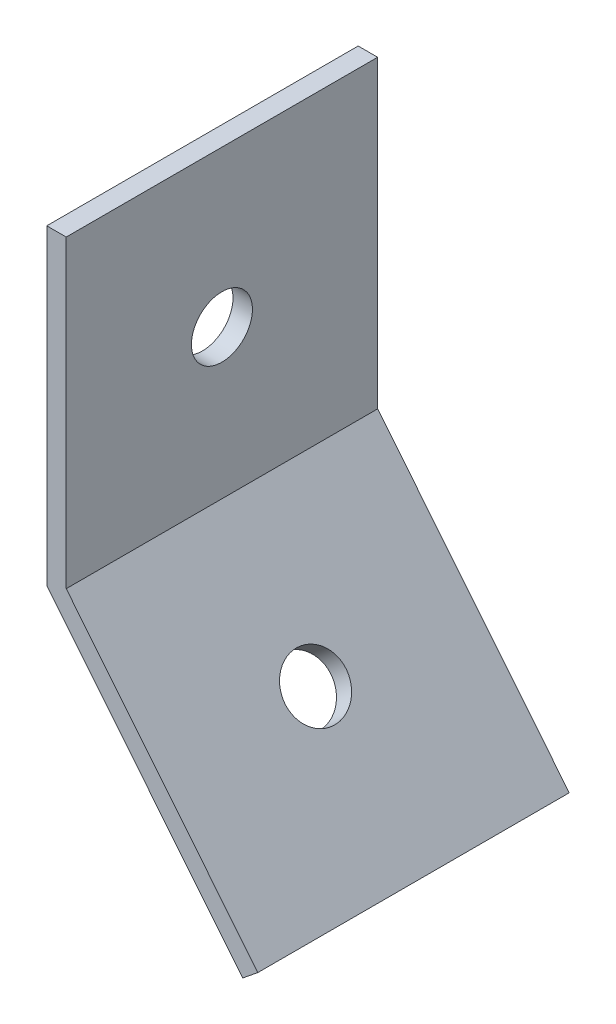
ISO-10303-21;
HEADER;
FILE_DESCRIPTION(('STEP AP214'),'2;1');
FILE_NAME('part.step','',(''),(''),'','','');
FILE_SCHEMA(('AUTOMOTIVE_DESIGN { 1 0 10303 214 1 1 1 1 }'));
ENDSEC;
DATA;
#1=APPLICATION_CONTEXT('core data for automotive mechanical design processes');
#2=APPLICATION_PROTOCOL_DEFINITION('international standard','automotive_design',2000,#1);
#3=PRODUCT_CONTEXT('',#1,'mechanical');
#4=PRODUCT('Part','Part','',(#3));
#5=PRODUCT_RELATED_PRODUCT_CATEGORY('part','',(#4));
#6=PRODUCT_DEFINITION_FORMATION('','',#4);
#7=PRODUCT_DEFINITION_CONTEXT('part definition',#1,'design');
#8=PRODUCT_DEFINITION('design','',#6,#7);
#9=PRODUCT_DEFINITION_SHAPE('','',#8);
#10=(LENGTH_UNIT() NAMED_UNIT(*) SI_UNIT(.MILLI.,.METRE.));
#11=(NAMED_UNIT(*) PLANE_ANGLE_UNIT() SI_UNIT($,.RADIAN.));
#12=(NAMED_UNIT(*) SI_UNIT($,.STERADIAN.) SOLID_ANGLE_UNIT());
#13=UNCERTAINTY_MEASURE_WITH_UNIT(LENGTH_MEASURE(1.E-05),#10,'distance_accuracy_value','');
#14=(GEOMETRIC_REPRESENTATION_CONTEXT(3) GLOBAL_UNCERTAINTY_ASSIGNED_CONTEXT((#13)) GLOBAL_UNIT_ASSIGNED_CONTEXT((#10,
#11,#12)) REPRESENTATION_CONTEXT('',''));
#15=CARTESIAN_POINT('',(0.,0.,0.));
#16=DIRECTION('',(0.,0.,1.));
#17=DIRECTION('',(1.,0.,0.));
#18=AXIS2_PLACEMENT_3D('',#15,#16,#17);
#19=CARTESIAN_POINT('',(50.8,736.60000000001,-25.4));
#20=DIRECTION('',(-0.777233462324333,-0.629212321115321,0.));
#21=DIRECTION('',(0.629212321115321,-0.777233462324333,0.));
#22=AXIS2_PLACEMENT_3D('',#19,#20,#21);
#23=PLANE('',#22);
#24=CARTESIAN_POINT('',(58.7909964781645,726.729135028491,-12.7));
#25=DIRECTION('',(-0.777233462324333,-0.629212321115321,0.));
#26=DIRECTION('',(0.629212321115321,-0.777233462324333,0.));
#27=AXIS2_PLACEMENT_3D('',#24,#25,#26);
#28=CIRCLE('',#27,2.48919999999999);
#29=CARTESIAN_POINT('',(60.3572317878848,724.794445494073,-12.7));
#30=VERTEX_POINT('',#29);
#31=EDGE_CURVE('E121',#30,#30,#28,.T.);
#32=ORIENTED_EDGE('',*,*,#31,.F.);
#33=EDGE_LOOP('',(#32));
#34=FACE_BOUND('',#33,.T.);
#35=DIRECTION('',(0.629212321115321,-0.777233462324333,0.));
#36=VECTOR('',#35,1.);
#37=CARTESIAN_POINT('',(50.8,736.60000000001,0.));
#38=LINE('',#37,#36);
#39=CARTESIAN_POINT('',(50.8,736.60000000001,0.));
#40=VERTEX_POINT('',#39);
#41=CARTESIAN_POINT('',(66.7819929563291,716.858270056972,0.));
#42=VERTEX_POINT('',#41);
#43=EDGE_CURVE('E117',#40,#42,#38,.T.);
#44=ORIENTED_EDGE('',*,*,#43,.F.);
#45=DIRECTION('',(0.,0.,1.));
#46=VECTOR('',#45,1.);
#47=CARTESIAN_POINT('',(50.8,736.60000000001,-25.4));
#48=LINE('',#47,#46);
#49=CARTESIAN_POINT('',(50.8,736.60000000001,-25.4));
#50=VERTEX_POINT('',#49);
#51=EDGE_CURVE('E11',#50,#40,#48,.T.);
#52=ORIENTED_EDGE('',*,*,#51,.F.);
#53=DIRECTION('',(0.629212321115321,-0.777233462324333,0.));
#54=VECTOR('',#53,1.);
#55=CARTESIAN_POINT('',(50.8,736.60000000001,-25.4));
#56=LINE('',#55,#54);
#57=CARTESIAN_POINT('',(66.7819929563291,716.858270056972,-25.4));
#58=VERTEX_POINT('',#57);
#59=EDGE_CURVE('E131',#50,#58,#56,.T.);
#60=ORIENTED_EDGE('',*,*,#59,.T.);
#61=DIRECTION('',(0.,0.,1.));
#62=VECTOR('',#61,1.);
#63=CARTESIAN_POINT('',(66.7819929563291,716.858270056972,-25.4));
#64=LINE('',#63,#62);
#65=EDGE_CURVE('E38',#58,#42,#64,.T.);
#66=ORIENTED_EDGE('',*,*,#65,.T.);
#67=EDGE_LOOP('',(#44,#52,#60,#66));
#68=FACE_BOUND('',#67,.T.);
#69=ADVANCED_FACE('F35',(#34,#68),#23,.T.);
#70=CARTESIAN_POINT('',(50.8,762.00000000001,-25.4));
#71=DIRECTION('',(-1.,0.,0.));
#72=DIRECTION('',(0.,0.,1.));
#73=AXIS2_PLACEMENT_3D('',#70,#71,#72);
#74=PLANE('',#73);
#75=CARTESIAN_POINT('',(50.8,749.30000000001,-12.7));
#76=DIRECTION('',(-1.,0.,0.));
#77=DIRECTION('',(0.,0.,1.));
#78=AXIS2_PLACEMENT_3D('',#75,#76,#77);
#79=CIRCLE('',#78,2.48919999999997);
#80=CARTESIAN_POINT('',(50.8,749.30000000001,-10.2108));
#81=VERTEX_POINT('',#80);
#82=EDGE_CURVE('E185',#81,#81,#79,.T.);
#83=ORIENTED_EDGE('',*,*,#82,.F.);
#84=EDGE_LOOP('',(#83));
#85=FACE_BOUND('',#84,.T.);
#86=DIRECTION('',(0.,-1.,0.));
#87=VECTOR('',#86,1.);
#88=CARTESIAN_POINT('',(50.8,762.00000000001,0.));
#89=LINE('',#88,#87);
#90=CARTESIAN_POINT('',(50.8,762.00000000001,0.));
#91=VERTEX_POINT('',#90);
#92=EDGE_CURVE('E129',#91,#40,#89,.T.);
#93=ORIENTED_EDGE('',*,*,#92,.F.);
#94=DIRECTION('',(0.,0.,1.));
#95=VECTOR('',#94,1.);
#96=CARTESIAN_POINT('',(50.8,762.00000000001,-25.4));
#97=LINE('',#96,#95);
#98=CARTESIAN_POINT('',(50.8,762.00000000001,-25.4));
#99=VERTEX_POINT('',#98);
#100=EDGE_CURVE('E44',#99,#91,#97,.T.);
#101=ORIENTED_EDGE('',*,*,#100,.F.);
#102=DIRECTION('',(0.,-1.,0.));
#103=VECTOR('',#102,1.);
#104=CARTESIAN_POINT('',(50.8,762.00000000001,-25.4));
#105=LINE('',#104,#103);
#106=EDGE_CURVE('E98',#99,#50,#105,.T.);
#107=ORIENTED_EDGE('',*,*,#106,.T.);
#108=ORIENTED_EDGE('',*,*,#51,.T.);
#109=EDGE_LOOP('',(#93,#101,#107,#108));
#110=FACE_BOUND('',#109,.T.);
#111=ADVANCED_FACE('F143',(#85,#110),#74,.T.);
#112=CARTESIAN_POINT('',(50.8,762.00000000001,-25.4));
#113=DIRECTION('',(0.,-1.,0.));
#114=DIRECTION('',(0.,0.,-1.));
#115=AXIS2_PLACEMENT_3D('',#112,#113,#114);
#116=PLANE('',#115);
#117=DIRECTION('',(1.,0.,0.));
#118=VECTOR('',#117,1.);
#119=CARTESIAN_POINT('',(50.8,762.00000000001,0.));
#120=LINE('',#119,#118);
#121=CARTESIAN_POINT('',(52.3875,762.00000000001,0.));
#122=VERTEX_POINT('',#121);
#123=EDGE_CURVE('E103',#91,#122,#120,.T.);
#124=ORIENTED_EDGE('',*,*,#123,.T.);
#125=DIRECTION('',(0.,0.,1.));
#126=VECTOR('',#125,1.);
#127=CARTESIAN_POINT('',(52.3875,762.00000000001,-25.4));
#128=LINE('',#127,#126);
#129=CARTESIAN_POINT('',(52.3875,762.00000000001,-25.4));
#130=VERTEX_POINT('',#129);
#131=EDGE_CURVE('E101',#130,#122,#128,.T.);
#132=ORIENTED_EDGE('',*,*,#131,.F.);
#133=DIRECTION('',(1.,0.,0.));
#134=VECTOR('',#133,1.);
#135=CARTESIAN_POINT('',(50.8,762.00000000001,-25.4));
#136=LINE('',#135,#134);
#137=EDGE_CURVE('E92',#99,#130,#136,.T.);
#138=ORIENTED_EDGE('',*,*,#137,.F.);
#139=ORIENTED_EDGE('',*,*,#100,.T.);
#140=EDGE_LOOP('',(#124,#132,#138,#139));
#141=FACE_BOUND('',#140,.T.);
#142=ADVANCED_FACE('F102',(#141),#116,.F.);
#143=CARTESIAN_POINT('',(52.3875,762.00000000001,-25.4));
#144=DIRECTION('',(-1.,0.,0.));
#145=DIRECTION('',(0.,0.,1.));
#146=AXIS2_PLACEMENT_3D('',#143,#144,#145);
#147=PLANE('',#146);
#148=CARTESIAN_POINT('',(52.3874999999992,749.30000000001,-12.7));
#149=DIRECTION('',(1.,0.,0.));
#150=DIRECTION('',(0.,0.,-1.));
#151=AXIS2_PLACEMENT_3D('',#148,#149,#150);
#152=CIRCLE('',#151,2.48919999999997);
#153=CARTESIAN_POINT('',(52.3874999999992,749.30000000001,-15.1892));
#154=VERTEX_POINT('',#153);
#155=EDGE_CURVE('E183',#154,#154,#152,.T.);
#156=ORIENTED_EDGE('',*,*,#155,.F.);
#157=EDGE_LOOP('',(#156));
#158=FACE_BOUND('',#157,.T.);
#159=DIRECTION('',(0.,1.,0.));
#160=VECTOR('',#159,1.);
#161=CARTESIAN_POINT('',(52.3875,762.00000000001,0.));
#162=LINE('',#161,#160);
#163=CARTESIAN_POINT('',(52.3875,737.162039023552,0.));
#164=VERTEX_POINT('',#163);
#165=EDGE_CURVE('E126',#122,#164,#162,.F.);
#166=ORIENTED_EDGE('',*,*,#165,.T.);
#167=DIRECTION('',(0.,0.,1.));
#168=VECTOR('',#167,1.);
#169=CARTESIAN_POINT('',(52.3875,737.162039023552,-25.4));
#170=LINE('',#169,#168);
#171=CARTESIAN_POINT('',(52.3875,737.162039023552,-25.4));
#172=VERTEX_POINT('',#171);
#173=EDGE_CURVE('E106',#172,#164,#170,.T.);
#174=ORIENTED_EDGE('',*,*,#173,.F.);
#175=DIRECTION('',(0.,1.,0.));
#176=VECTOR('',#175,1.);
#177=CARTESIAN_POINT('',(52.3875,762.00000000001,-25.4));
#178=LINE('',#177,#176);
#179=EDGE_CURVE('E96',#130,#172,#178,.F.);
#180=ORIENTED_EDGE('',*,*,#179,.F.);
#181=ORIENTED_EDGE('',*,*,#131,.T.);
#182=EDGE_LOOP('',(#166,#174,#180,#181));
#183=FACE_BOUND('',#182,.T.);
#184=ADVANCED_FACE('F108',(#158,#183),#147,.F.);
#185=CARTESIAN_POINT('',(52.0338581214399,737.59887455978,-25.4));
#186=DIRECTION('',(-0.777233462324333,-0.629212321115321,0.));
#187=DIRECTION('',(0.629212321115321,-0.777233462324333,0.));
#188=AXIS2_PLACEMENT_3D('',#185,#186,#187);
#189=PLANE('',#188);
#190=CARTESIAN_POINT('',(60.0248545996039,727.728009588261,-12.7));
#191=DIRECTION('',(0.777233462324332,0.629212321115322,0.));
#192=DIRECTION('',(-0.629212321115322,0.777233462324332,0.));
#193=AXIS2_PLACEMENT_3D('',#190,#191,#192);
#194=CIRCLE('',#193,2.48919999999999);
#195=CARTESIAN_POINT('',(58.4586192898836,729.662699122679,-12.7));
#196=VERTEX_POINT('',#195);
#197=EDGE_CURVE('E186',#196,#196,#194,.T.);
#198=ORIENTED_EDGE('',*,*,#197,.F.);
#199=EDGE_LOOP('',(#198));
#200=FACE_BOUND('',#199,.T.);
#201=DIRECTION('',(0.629212321115321,-0.777233462324333,0.));
#202=VECTOR('',#201,1.);
#203=CARTESIAN_POINT('',(52.0338581214399,737.59887455978,0.));
#204=LINE('',#203,#202);
#205=CARTESIAN_POINT('',(68.015851077769,717.857144616742,0.));
#206=VERTEX_POINT('',#205);
#207=EDGE_CURVE('E124',#164,#206,#204,.T.);
#208=ORIENTED_EDGE('',*,*,#207,.T.);
#209=DIRECTION('',(0.,0.,1.));
#210=VECTOR('',#209,1.);
#211=CARTESIAN_POINT('',(68.015851077769,717.857144616742,-25.4));
#212=LINE('',#211,#210);
#213=CARTESIAN_POINT('',(68.015851077769,717.857144616742,-25.4));
#214=VERTEX_POINT('',#213);
#215=EDGE_CURVE('E134',#214,#206,#212,.T.);
#216=ORIENTED_EDGE('',*,*,#215,.F.);
#217=DIRECTION('',(0.629212321115321,-0.777233462324333,0.));
#218=VECTOR('',#217,1.);
#219=CARTESIAN_POINT('',(52.0338581214399,737.59887455978,-25.4));
#220=LINE('',#219,#218);
#221=EDGE_CURVE('E111',#172,#214,#220,.T.);
#222=ORIENTED_EDGE('',*,*,#221,.F.);
#223=ORIENTED_EDGE('',*,*,#173,.T.);
#224=EDGE_LOOP('',(#208,#216,#222,#223));
#225=FACE_BOUND('',#224,.T.);
#226=ADVANCED_FACE('F159',(#200,#225),#189,.F.);
#227=CARTESIAN_POINT('',(68.015851077769,717.857144616742,-25.4));
#228=DIRECTION('',(-0.629212321115312,0.77723346232434,0.));
#229=DIRECTION('',(-0.77723346232434,-0.629212321115312,0.));
#230=AXIS2_PLACEMENT_3D('',#227,#228,#229);
#231=PLANE('',#230);
#232=DIRECTION('',(-0.77723346232434,-0.629212321115312,0.));
#233=VECTOR('',#232,1.);
#234=CARTESIAN_POINT('',(68.015851077769,717.857144616742,0.));
#235=LINE('',#234,#233);
#236=EDGE_CURVE('E120',#206,#42,#235,.T.);
#237=ORIENTED_EDGE('',*,*,#236,.T.);
#238=ORIENTED_EDGE('',*,*,#65,.F.);
#239=DIRECTION('',(-0.77723346232434,-0.629212321115312,0.));
#240=VECTOR('',#239,1.);
#241=CARTESIAN_POINT('',(68.015851077769,717.857144616742,-25.4));
#242=LINE('',#241,#240);
#243=EDGE_CURVE('E84',#214,#58,#242,.T.);
#244=ORIENTED_EDGE('',*,*,#243,.F.);
#245=ORIENTED_EDGE('',*,*,#215,.T.);
#246=EDGE_LOOP('',(#237,#238,#244,#245));
#247=FACE_BOUND('',#246,.T.);
#248=ADVANCED_FACE('F139',(#247),#231,.F.);
#249=CARTESIAN_POINT('',(0.,0.,-25.4));
#250=DIRECTION('',(0.,0.,-1.));
#251=DIRECTION('',(-1.,0.,0.));
#252=AXIS2_PLACEMENT_3D('',#249,#250,#251);
#253=PLANE('',#252);
#254=ORIENTED_EDGE('',*,*,#59,.F.);
#255=ORIENTED_EDGE('',*,*,#106,.F.);
#256=ORIENTED_EDGE('',*,*,#137,.T.);
#257=ORIENTED_EDGE('',*,*,#179,.T.);
#258=ORIENTED_EDGE('',*,*,#221,.T.);
#259=ORIENTED_EDGE('',*,*,#243,.T.);
#260=EDGE_LOOP('',(#254,#255,#256,#257,#258,#259));
#261=FACE_BOUND('',#260,.T.);
#262=ADVANCED_FACE('F94',(#261),#253,.T.);
#263=CARTESIAN_POINT('',(0.,0.,0.));
#264=DIRECTION('',(0.,0.,-1.));
#265=DIRECTION('',(-1.,0.,0.));
#266=AXIS2_PLACEMENT_3D('',#263,#264,#265);
#267=PLANE('',#266);
#268=ORIENTED_EDGE('',*,*,#43,.T.);
#269=ORIENTED_EDGE('',*,*,#236,.F.);
#270=ORIENTED_EDGE('',*,*,#207,.F.);
#271=ORIENTED_EDGE('',*,*,#165,.F.);
#272=ORIENTED_EDGE('',*,*,#123,.F.);
#273=ORIENTED_EDGE('',*,*,#92,.T.);
#274=EDGE_LOOP('',(#268,#269,#270,#271,#272,#273));
#275=FACE_BOUND('',#274,.T.);
#276=ADVANCED_FACE('F142',(#275),#267,.F.);
#277=CARTESIAN_POINT('',(60.0248545996039,727.728009588261,-12.7));
#278=DIRECTION('',(0.777233462324332,0.629212321115322,0.));
#279=DIRECTION('',(-0.629212321115322,0.777233462324332,0.));
#280=AXIS2_PLACEMENT_3D('',#277,#278,#279);
#281=CYLINDRICAL_SURFACE('',#280,2.48919999999999);
#282=ORIENTED_EDGE('',*,*,#197,.T.);
#283=EDGE_LOOP('',(#282));
#284=FACE_BOUND('',#283,.T.);
#285=ORIENTED_EDGE('',*,*,#31,.T.);
#286=EDGE_LOOP('',(#285));
#287=FACE_BOUND('',#286,.T.);
#288=ADVANCED_FACE('F170',(#284,#287),#281,.F.);
#289=CARTESIAN_POINT('',(52.3874999999992,749.30000000001,-12.7));
#290=DIRECTION('',(1.,0.,0.));
#291=DIRECTION('',(0.,0.,-1.));
#292=AXIS2_PLACEMENT_3D('',#289,#290,#291);
#293=CYLINDRICAL_SURFACE('',#292,2.48919999999997);
#294=ORIENTED_EDGE('',*,*,#155,.T.);
#295=EDGE_LOOP('',(#294));
#296=FACE_BOUND('',#295,.T.);
#297=ORIENTED_EDGE('',*,*,#82,.T.);
#298=EDGE_LOOP('',(#297));
#299=FACE_BOUND('',#298,.T.);
#300=ADVANCED_FACE('F174',(#296,#299),#293,.F.);
#301=CLOSED_SHELL('',(#69,#111,#142,#184,#226,#248,#262,#276,#288,#300));
#302=MANIFOLD_SOLID_BREP('B2',#301);
#303=ADVANCED_BREP_SHAPE_REPRESENTATION('',(#18,#302),#14);
#304=SHAPE_DEFINITION_REPRESENTATION(#9,#303);
ENDSEC;
END-ISO-10303-21;
